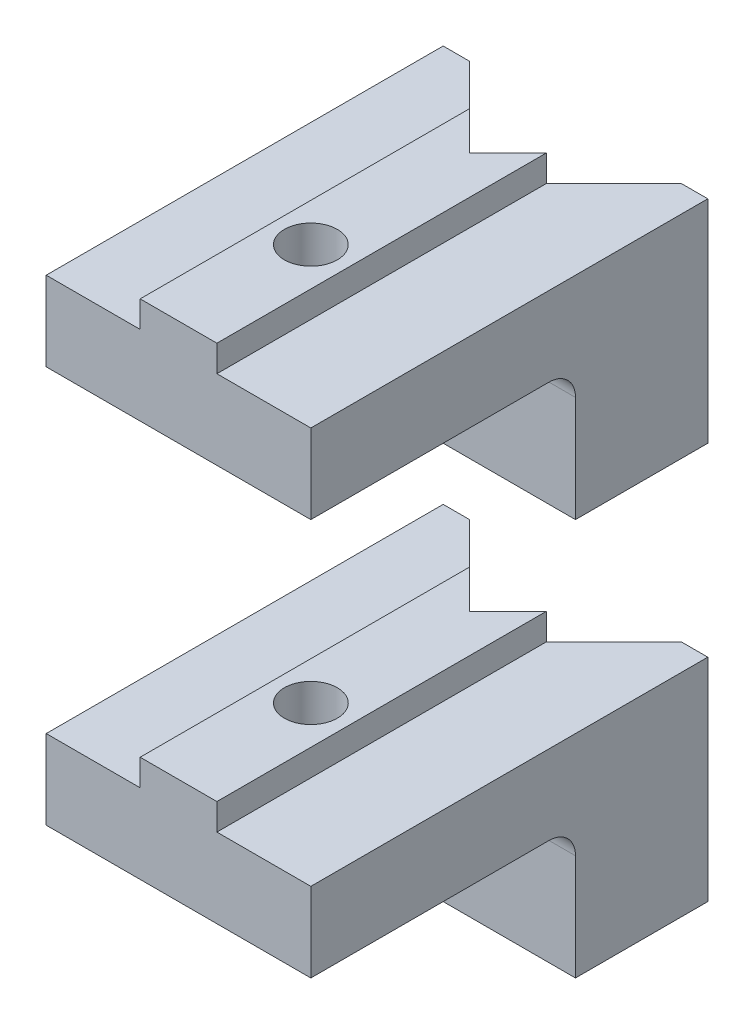
ISO-10303-21;
HEADER;
FILE_DESCRIPTION(('STEP AP214'),'2;1');
FILE_NAME('part.step','',(''),(''),'','','');
FILE_SCHEMA(('AUTOMOTIVE_DESIGN { 1 0 10303 214 1 1 1 1 }'));
ENDSEC;
DATA;
#1=APPLICATION_CONTEXT('core data for automotive mechanical design processes');
#2=APPLICATION_PROTOCOL_DEFINITION('international standard','automotive_design',2000,#1);
#3=PRODUCT_CONTEXT('',#1,'mechanical');
#4=PRODUCT('Part','Part','',(#3));
#5=PRODUCT_RELATED_PRODUCT_CATEGORY('part','',(#4));
#6=PRODUCT_DEFINITION_FORMATION('','',#4);
#7=PRODUCT_DEFINITION_CONTEXT('part definition',#1,'design');
#8=PRODUCT_DEFINITION('design','',#6,#7);
#9=PRODUCT_DEFINITION_SHAPE('','',#8);
#10=(LENGTH_UNIT() NAMED_UNIT(*) SI_UNIT(.MILLI.,.METRE.));
#11=(NAMED_UNIT(*) PLANE_ANGLE_UNIT() SI_UNIT($,.RADIAN.));
#12=(NAMED_UNIT(*) SI_UNIT($,.STERADIAN.) SOLID_ANGLE_UNIT());
#13=UNCERTAINTY_MEASURE_WITH_UNIT(LENGTH_MEASURE(1.E-05),#10,'distance_accuracy_value','');
#14=(GEOMETRIC_REPRESENTATION_CONTEXT(3) GLOBAL_UNCERTAINTY_ASSIGNED_CONTEXT((#13)) GLOBAL_UNIT_ASSIGNED_CONTEXT((#10,
#11,#12)) REPRESENTATION_CONTEXT('',''));
#15=CARTESIAN_POINT('',(0.,0.,0.));
#16=DIRECTION('',(0.,0.,1.));
#17=DIRECTION('',(1.,0.,0.));
#18=AXIS2_PLACEMENT_3D('',#15,#16,#17);
#19=CARTESIAN_POINT('',(5.,15.,15.));
#20=DIRECTION('',(0.,1.,0.));
#21=DIRECTION('',(-1.,0.,0.));
#22=AXIS2_PLACEMENT_3D('',#19,#20,#21);
#23=PLANE('',#22);
#24=CARTESIAN_POINT('',(0.,15.,10.));
#25=DIRECTION('',(0.,1.,0.));
#26=DIRECTION('',(0.,0.,1.));
#27=AXIS2_PLACEMENT_3D('',#24,#25,#26);
#28=CIRCLE('',#27,1.);
#29=CARTESIAN_POINT('',(0.,15.,11.));
#30=VERTEX_POINT('',#29);
#31=EDGE_CURVE('E154',#30,#30,#28,.T.);
#32=ORIENTED_EDGE('',*,*,#31,.T.);
#33=EDGE_LOOP('',(#32));
#34=FACE_BOUND('',#33,.T.);
#35=DIRECTION('',(0.,0.,-1.));
#36=VECTOR('',#35,1.);
#37=CARTESIAN_POINT('',(-5.,15.,15.));
#38=LINE('',#37,#36);
#39=CARTESIAN_POINT('',(-5.,15.,15.));
#40=VERTEX_POINT('',#39);
#41=CARTESIAN_POINT('',(-5.,15.,6.));
#42=VERTEX_POINT('',#41);
#43=EDGE_CURVE('E227',#40,#42,#38,.T.);
#44=ORIENTED_EDGE('',*,*,#43,.T.);
#45=DIRECTION('',(-1.,0.,0.));
#46=VECTOR('',#45,1.);
#47=CARTESIAN_POINT('',(5.,15.,6.));
#48=LINE('',#47,#46);
#49=CARTESIAN_POINT('',(5.,15.,6.));
#50=VERTEX_POINT('',#49);
#51=EDGE_CURVE('E63',#42,#50,#48,.F.);
#52=ORIENTED_EDGE('',*,*,#51,.T.);
#53=DIRECTION('',(0.,0.,-1.));
#54=VECTOR('',#53,1.);
#55=CARTESIAN_POINT('',(5.,15.,15.));
#56=LINE('',#55,#54);
#57=CARTESIAN_POINT('',(5.,15.,15.));
#58=VERTEX_POINT('',#57);
#59=EDGE_CURVE('E251',#58,#50,#56,.T.);
#60=ORIENTED_EDGE('',*,*,#59,.F.);
#61=DIRECTION('',(1.,0.,0.));
#62=VECTOR('',#61,1.);
#63=CARTESIAN_POINT('',(5.,15.,15.));
#64=LINE('',#63,#62);
#65=EDGE_CURVE('E210',#40,#58,#64,.T.);
#66=ORIENTED_EDGE('',*,*,#65,.F.);
#67=EDGE_LOOP('',(#44,#52,#60,#66));
#68=FACE_BOUND('',#67,.T.);
#69=ADVANCED_FACE('F42',(#34,#68),#23,.F.);
#70=CARTESIAN_POINT('',(0.,15.,0.));
#71=DIRECTION('',(0.,0.,-1.));
#72=DIRECTION('',(-1.,0.,0.));
#73=AXIS2_PLACEMENT_3D('',#70,#71,#72);
#74=PLANE('',#73);
#75=DIRECTION('',(0.,1.,0.));
#76=VECTOR('',#75,1.);
#77=CARTESIAN_POINT('',(-4.,15.,0.));
#78=LINE('',#77,#76);
#79=CARTESIAN_POINT('',(-4.,10.,0.));
#80=VERTEX_POINT('',#79);
#81=CARTESIAN_POINT('',(-4.,18.,0.));
#82=VERTEX_POINT('',#81);
#83=EDGE_CURVE('E255',#80,#82,#78,.T.);
#84=ORIENTED_EDGE('',*,*,#83,.F.);
#85=DIRECTION('',(1.,0.,0.));
#86=VECTOR('',#85,1.);
#87=CARTESIAN_POINT('',(-5.,10.,0.));
#88=LINE('',#87,#86);
#89=CARTESIAN_POINT('',(-5.,10.,0.));
#90=VERTEX_POINT('',#89);
#91=EDGE_CURVE('E176',#90,#80,#88,.T.);
#92=ORIENTED_EDGE('',*,*,#91,.F.);
#93=DIRECTION('',(0.,-1.,0.));
#94=VECTOR('',#93,1.);
#95=CARTESIAN_POINT('',(-5.,15.,0.));
#96=LINE('',#95,#94);
#97=CARTESIAN_POINT('',(-5.,18.,0.));
#98=VERTEX_POINT('',#97);
#99=EDGE_CURVE('E214',#98,#90,#96,.T.);
#100=ORIENTED_EDGE('',*,*,#99,.F.);
#101=DIRECTION('',(-1.,0.,0.));
#102=VECTOR('',#101,1.);
#103=CARTESIAN_POINT('',(-5.,18.,0.));
#104=LINE('',#103,#102);
#105=EDGE_CURVE('E230',#82,#98,#104,.T.);
#106=ORIENTED_EDGE('',*,*,#105,.F.);
#107=EDGE_LOOP('',(#84,#92,#100,#106));
#108=FACE_BOUND('',#107,.T.);
#109=ADVANCED_FACE('F272',(#108),#74,.T.);
#110=CARTESIAN_POINT('',(5.,18.,15.));
#111=DIRECTION('',(-1.,0.,0.));
#112=DIRECTION('',(0.,-1.,0.));
#113=AXIS2_PLACEMENT_3D('',#110,#111,#112);
#114=PLANE('',#113);
#115=DIRECTION('',(0.,1.,0.));
#116=VECTOR('',#115,1.);
#117=CARTESIAN_POINT('',(5.,18.,0.));
#118=LINE('',#117,#116);
#119=CARTESIAN_POINT('',(5.,10.,0.));
#120=VERTEX_POINT('',#119);
#121=CARTESIAN_POINT('',(5.,18.,0.));
#122=VERTEX_POINT('',#121);
#123=EDGE_CURVE('E143',#120,#122,#118,.T.);
#124=ORIENTED_EDGE('',*,*,#123,.T.);
#125=DIRECTION('',(0.,0.,-1.));
#126=VECTOR('',#125,1.);
#127=CARTESIAN_POINT('',(5.,18.,15.));
#128=LINE('',#127,#126);
#129=CARTESIAN_POINT('',(5.,18.,15.));
#130=VERTEX_POINT('',#129);
#131=EDGE_CURVE('E249',#130,#122,#128,.T.);
#132=ORIENTED_EDGE('',*,*,#131,.F.);
#133=DIRECTION('',(0.,1.,0.));
#134=VECTOR('',#133,1.);
#135=CARTESIAN_POINT('',(5.,18.,15.));
#136=LINE('',#135,#134);
#137=EDGE_CURVE('E213',#58,#130,#136,.T.);
#138=ORIENTED_EDGE('',*,*,#137,.F.);
#139=ORIENTED_EDGE('',*,*,#59,.T.);
#140=CARTESIAN_POINT('',(5.,14.,6.));
#141=DIRECTION('',(-1.,0.,0.));
#142=DIRECTION('',(0.,-1.,0.));
#143=AXIS2_PLACEMENT_3D('',#140,#141,#142);
#144=CIRCLE('',#143,1.);
#145=CARTESIAN_POINT('',(5.,14.,5.));
#146=VERTEX_POINT('',#145);
#147=EDGE_CURVE('E12',#50,#146,#144,.T.);
#148=ORIENTED_EDGE('',*,*,#147,.T.);
#149=DIRECTION('',(0.,1.,0.));
#150=VECTOR('',#149,1.);
#151=CARTESIAN_POINT('',(5.,10.,5.));
#152=LINE('',#151,#150);
#153=CARTESIAN_POINT('',(5.,10.,5.));
#154=VERTEX_POINT('',#153);
#155=EDGE_CURVE('E160',#154,#146,#152,.T.);
#156=ORIENTED_EDGE('',*,*,#155,.F.);
#157=DIRECTION('',(0.,0.,1.));
#158=VECTOR('',#157,1.);
#159=CARTESIAN_POINT('',(5.,10.,0.));
#160=LINE('',#159,#158);
#161=EDGE_CURVE('E157',#120,#154,#160,.T.);
#162=ORIENTED_EDGE('',*,*,#161,.F.);
#163=EDGE_LOOP('',(#124,#132,#138,#139,#148,#156,#162));
#164=FACE_BOUND('',#163,.T.);
#165=ADVANCED_FACE('F158',(#164),#114,.F.);
#166=CARTESIAN_POINT('',(1.45,18.,15.));
#167=DIRECTION('',(0.,-1.,0.));
#168=DIRECTION('',(1.,0.,0.));
#169=AXIS2_PLACEMENT_3D('',#166,#167,#168);
#170=PLANE('',#169);
#171=DIRECTION('',(-1.,0.,0.));
#172=VECTOR('',#171,1.);
#173=CARTESIAN_POINT('',(1.45,18.,0.));
#174=LINE('',#173,#172);
#175=CARTESIAN_POINT('',(4.,18.,0.));
#176=VERTEX_POINT('',#175);
#177=EDGE_CURVE('E150',#122,#176,#174,.T.);
#178=ORIENTED_EDGE('',*,*,#177,.T.);
#179=DIRECTION('',(-0.707106781186548,0.,0.707106781186548));
#180=VECTOR('',#179,1.);
#181=CARTESIAN_POINT('',(-4.775,18.,8.775));
#182=LINE('',#181,#180);
#183=CARTESIAN_POINT('',(1.45,18.,2.55));
#184=VERTEX_POINT('',#183);
#185=EDGE_CURVE('E193',#176,#184,#182,.T.);
#186=ORIENTED_EDGE('',*,*,#185,.T.);
#187=DIRECTION('',(0.,0.,-1.));
#188=VECTOR('',#187,1.);
#189=CARTESIAN_POINT('',(1.45,18.,15.));
#190=LINE('',#189,#188);
#191=CARTESIAN_POINT('',(1.45,18.,15.));
#192=VERTEX_POINT('',#191);
#193=EDGE_CURVE('E246',#192,#184,#190,.T.);
#194=ORIENTED_EDGE('',*,*,#193,.F.);
#195=DIRECTION('',(-1.,0.,0.));
#196=VECTOR('',#195,1.);
#197=CARTESIAN_POINT('',(1.45,18.,15.));
#198=LINE('',#197,#196);
#199=EDGE_CURVE('E216',#130,#192,#198,.T.);
#200=ORIENTED_EDGE('',*,*,#199,.F.);
#201=ORIENTED_EDGE('',*,*,#131,.T.);
#202=EDGE_LOOP('',(#178,#186,#194,#200,#201));
#203=FACE_BOUND('',#202,.T.);
#204=ADVANCED_FACE('F298',(#203),#170,.F.);
#205=CARTESIAN_POINT('',(1.45,19.,15.));
#206=DIRECTION('',(-1.,0.,0.));
#207=DIRECTION('',(0.,-1.,0.));
#208=AXIS2_PLACEMENT_3D('',#205,#206,#207);
#209=PLANE('',#208);
#210=ORIENTED_EDGE('',*,*,#193,.T.);
#211=DIRECTION('',(0.,1.,0.));
#212=VECTOR('',#211,1.);
#213=CARTESIAN_POINT('',(1.45,19.,2.55));
#214=LINE('',#213,#212);
#215=CARTESIAN_POINT('',(1.45,19.,2.55));
#216=VERTEX_POINT('',#215);
#217=EDGE_CURVE('E196',#184,#216,#214,.T.);
#218=ORIENTED_EDGE('',*,*,#217,.T.);
#219=DIRECTION('',(0.,0.,-1.));
#220=VECTOR('',#219,1.);
#221=CARTESIAN_POINT('',(1.45,19.,15.));
#222=LINE('',#221,#220);
#223=CARTESIAN_POINT('',(1.45,19.,15.));
#224=VERTEX_POINT('',#223);
#225=EDGE_CURVE('E243',#224,#216,#222,.T.);
#226=ORIENTED_EDGE('',*,*,#225,.F.);
#227=DIRECTION('',(0.,1.,0.));
#228=VECTOR('',#227,1.);
#229=CARTESIAN_POINT('',(1.45,19.,15.));
#230=LINE('',#229,#228);
#231=EDGE_CURVE('E218',#192,#224,#230,.T.);
#232=ORIENTED_EDGE('',*,*,#231,.F.);
#233=EDGE_LOOP('',(#210,#218,#226,#232));
#234=FACE_BOUND('',#233,.T.);
#235=ADVANCED_FACE('F293',(#234),#209,.F.);
#236=CARTESIAN_POINT('',(-1.45,19.,15.));
#237=DIRECTION('',(0.,-1.,0.));
#238=DIRECTION('',(1.,0.,0.));
#239=AXIS2_PLACEMENT_3D('',#236,#237,#238);
#240=PLANE('',#239);
#241=CARTESIAN_POINT('',(0.,19.,10.));
#242=DIRECTION('',(0.,1.,0.));
#243=DIRECTION('',(0.,0.,1.));
#244=AXIS2_PLACEMENT_3D('',#241,#242,#243);
#245=CIRCLE('',#244,1.);
#246=CARTESIAN_POINT('',(0.,19.,11.));
#247=VERTEX_POINT('',#246);
#248=EDGE_CURVE('E205',#247,#247,#245,.T.);
#249=ORIENTED_EDGE('',*,*,#248,.F.);
#250=EDGE_LOOP('',(#249));
#251=FACE_BOUND('',#250,.T.);
#252=DIRECTION('',(-0.707106781186548,0.,0.707106781186548));
#253=VECTOR('',#252,1.);
#254=CARTESIAN_POINT('',(0.,19.,4.));
#255=LINE('',#254,#253);
#256=CARTESIAN_POINT('',(0.,19.,4.));
#257=VERTEX_POINT('',#256);
#258=EDGE_CURVE('E185',#216,#257,#255,.T.);
#259=ORIENTED_EDGE('',*,*,#258,.T.);
#260=DIRECTION('',(-0.707106781186548,0.,-0.707106781186547));
#261=VECTOR('',#260,1.);
#262=CARTESIAN_POINT('',(-5.,19.,-1.));
#263=LINE('',#262,#261);
#264=CARTESIAN_POINT('',(-1.45,19.,2.55));
#265=VERTEX_POINT('',#264);
#266=EDGE_CURVE('E188',#257,#265,#263,.T.);
#267=ORIENTED_EDGE('',*,*,#266,.T.);
#268=DIRECTION('',(0.,0.,-1.));
#269=VECTOR('',#268,1.);
#270=CARTESIAN_POINT('',(-1.45,19.,15.));
#271=LINE('',#270,#269);
#272=CARTESIAN_POINT('',(-1.45,19.,15.));
#273=VERTEX_POINT('',#272);
#274=EDGE_CURVE('E240',#273,#265,#271,.T.);
#275=ORIENTED_EDGE('',*,*,#274,.F.);
#276=DIRECTION('',(-1.,0.,0.));
#277=VECTOR('',#276,1.);
#278=CARTESIAN_POINT('',(-1.45,19.,15.));
#279=LINE('',#278,#277);
#280=EDGE_CURVE('E220',#224,#273,#279,.T.);
#281=ORIENTED_EDGE('',*,*,#280,.F.);
#282=ORIENTED_EDGE('',*,*,#225,.T.);
#283=EDGE_LOOP('',(#259,#267,#275,#281,#282));
#284=FACE_BOUND('',#283,.T.);
#285=ADVANCED_FACE('F287',(#251,#284),#240,.F.);
#286=CARTESIAN_POINT('',(-1.45,18.,15.));
#287=DIRECTION('',(1.,0.,0.));
#288=DIRECTION('',(0.,0.,-1.));
#289=AXIS2_PLACEMENT_3D('',#286,#287,#288);
#290=PLANE('',#289);
#291=ORIENTED_EDGE('',*,*,#274,.T.);
#292=DIRECTION('',(0.,-1.,0.));
#293=VECTOR('',#292,1.);
#294=CARTESIAN_POINT('',(-1.45,18.,2.55));
#295=LINE('',#294,#293);
#296=CARTESIAN_POINT('',(-1.45,18.,2.55));
#297=VERTEX_POINT('',#296);
#298=EDGE_CURVE('E202',#265,#297,#295,.T.);
#299=ORIENTED_EDGE('',*,*,#298,.T.);
#300=DIRECTION('',(0.,0.,-1.));
#301=VECTOR('',#300,1.);
#302=CARTESIAN_POINT('',(-1.45,18.,15.));
#303=LINE('',#302,#301);
#304=CARTESIAN_POINT('',(-1.45,18.,15.));
#305=VERTEX_POINT('',#304);
#306=EDGE_CURVE('E237',#305,#297,#303,.T.);
#307=ORIENTED_EDGE('',*,*,#306,.F.);
#308=DIRECTION('',(0.,-1.,0.));
#309=VECTOR('',#308,1.);
#310=CARTESIAN_POINT('',(-1.45,18.,15.));
#311=LINE('',#310,#309);
#312=EDGE_CURVE('E222',#273,#305,#311,.T.);
#313=ORIENTED_EDGE('',*,*,#312,.F.);
#314=EDGE_LOOP('',(#291,#299,#307,#313));
#315=FACE_BOUND('',#314,.T.);
#316=ADVANCED_FACE('F284',(#315),#290,.F.);
#317=CARTESIAN_POINT('',(-5.,18.,15.));
#318=DIRECTION('',(0.,-1.,0.));
#319=DIRECTION('',(0.,0.,-1.));
#320=AXIS2_PLACEMENT_3D('',#317,#318,#319);
#321=PLANE('',#320);
#322=ORIENTED_EDGE('',*,*,#306,.T.);
#323=DIRECTION('',(-0.707106781186548,0.,-0.707106781186547));
#324=VECTOR('',#323,1.);
#325=CARTESIAN_POINT('',(3.,18.,7.));
#326=LINE('',#325,#324);
#327=EDGE_CURVE('E199',#297,#82,#326,.T.);
#328=ORIENTED_EDGE('',*,*,#327,.T.);
#329=ORIENTED_EDGE('',*,*,#105,.T.);
#330=DIRECTION('',(0.,0.,-1.));
#331=VECTOR('',#330,1.);
#332=CARTESIAN_POINT('',(-5.,18.,15.));
#333=LINE('',#332,#331);
#334=CARTESIAN_POINT('',(-5.,18.,15.));
#335=VERTEX_POINT('',#334);
#336=EDGE_CURVE('E234',#335,#98,#333,.T.);
#337=ORIENTED_EDGE('',*,*,#336,.F.);
#338=DIRECTION('',(-1.,0.,0.));
#339=VECTOR('',#338,1.);
#340=CARTESIAN_POINT('',(-5.,18.,15.));
#341=LINE('',#340,#339);
#342=EDGE_CURVE('E224',#305,#335,#341,.T.);
#343=ORIENTED_EDGE('',*,*,#342,.F.);
#344=EDGE_LOOP('',(#322,#328,#329,#337,#343));
#345=FACE_BOUND('',#344,.T.);
#346=ADVANCED_FACE('F278',(#345),#321,.F.);
#347=CARTESIAN_POINT('',(-5.,15.,15.));
#348=DIRECTION('',(1.,0.,0.));
#349=DIRECTION('',(0.,0.,-1.));
#350=AXIS2_PLACEMENT_3D('',#347,#348,#349);
#351=PLANE('',#350);
#352=ORIENTED_EDGE('',*,*,#99,.T.);
#353=DIRECTION('',(0.,0.,-1.));
#354=VECTOR('',#353,1.);
#355=CARTESIAN_POINT('',(-5.,10.,5.));
#356=LINE('',#355,#354);
#357=CARTESIAN_POINT('',(-5.,10.,5.));
#358=VERTEX_POINT('',#357);
#359=EDGE_CURVE('E173',#358,#90,#356,.T.);
#360=ORIENTED_EDGE('',*,*,#359,.F.);
#361=DIRECTION('',(0.,1.,0.));
#362=VECTOR('',#361,1.);
#363=CARTESIAN_POINT('',(-5.,10.,5.));
#364=LINE('',#363,#362);
#365=CARTESIAN_POINT('',(-5.,14.,5.));
#366=VERTEX_POINT('',#365);
#367=EDGE_CURVE('E182',#358,#366,#364,.T.);
#368=ORIENTED_EDGE('',*,*,#367,.T.);
#369=CARTESIAN_POINT('',(-5.,14.,6.));
#370=DIRECTION('',(1.,0.,0.));
#371=DIRECTION('',(0.,0.,-1.));
#372=AXIS2_PLACEMENT_3D('',#369,#370,#371);
#373=CIRCLE('',#372,1.);
#374=EDGE_CURVE('E50',#366,#42,#373,.T.);
#375=ORIENTED_EDGE('',*,*,#374,.T.);
#376=ORIENTED_EDGE('',*,*,#43,.F.);
#377=DIRECTION('',(0.,-1.,0.));
#378=VECTOR('',#377,1.);
#379=CARTESIAN_POINT('',(-5.,15.,15.));
#380=LINE('',#379,#378);
#381=EDGE_CURVE('E226',#335,#40,#380,.T.);
#382=ORIENTED_EDGE('',*,*,#381,.F.);
#383=ORIENTED_EDGE('',*,*,#336,.T.);
#384=EDGE_LOOP('',(#352,#360,#368,#375,#376,#382,#383));
#385=FACE_BOUND('',#384,.T.);
#386=ADVANCED_FACE('F267',(#385),#351,.F.);
#387=CARTESIAN_POINT('',(0.,15.,15.));
#388=DIRECTION('',(0.,0.,-1.));
#389=DIRECTION('',(-1.,0.,0.));
#390=AXIS2_PLACEMENT_3D('',#387,#388,#389);
#391=PLANE('',#390);
#392=ORIENTED_EDGE('',*,*,#65,.T.);
#393=ORIENTED_EDGE('',*,*,#137,.T.);
#394=ORIENTED_EDGE('',*,*,#199,.T.);
#395=ORIENTED_EDGE('',*,*,#231,.T.);
#396=ORIENTED_EDGE('',*,*,#280,.T.);
#397=ORIENTED_EDGE('',*,*,#312,.T.);
#398=ORIENTED_EDGE('',*,*,#342,.T.);
#399=ORIENTED_EDGE('',*,*,#381,.T.);
#400=EDGE_LOOP('',(#392,#393,#394,#395,#396,#397,#398,#399));
#401=FACE_BOUND('',#400,.T.);
#402=ADVANCED_FACE('F301',(#401),#391,.F.);
#403=DIRECTION('',(0.,-1.,0.));
#404=VECTOR('',#403,1.);
#405=CARTESIAN_POINT('',(4.,15.,0.));
#406=LINE('',#405,#404);
#407=CARTESIAN_POINT('',(4.,10.,0.));
#408=VERTEX_POINT('',#407);
#409=EDGE_CURVE('E253',#176,#408,#406,.T.);
#410=ORIENTED_EDGE('',*,*,#409,.F.);
#411=ORIENTED_EDGE('',*,*,#177,.F.);
#412=ORIENTED_EDGE('',*,*,#123,.F.);
#413=DIRECTION('',(1.,0.,0.));
#414=VECTOR('',#413,1.);
#415=CARTESIAN_POINT('',(4.,10.,0.));
#416=LINE('',#415,#414);
#417=EDGE_CURVE('E148',#408,#120,#416,.T.);
#418=ORIENTED_EDGE('',*,*,#417,.F.);
#419=EDGE_LOOP('',(#410,#411,#412,#418));
#420=FACE_BOUND('',#419,.T.);
#421=ADVANCED_FACE('F146',(#420),#74,.T.);
#422=CARTESIAN_POINT('',(0.,15.,10.));
#423=DIRECTION('',(0.,1.,0.));
#424=DIRECTION('',(0.,0.,1.));
#425=AXIS2_PLACEMENT_3D('',#422,#423,#424);
#426=CYLINDRICAL_SURFACE('',#425,1.);
#427=ORIENTED_EDGE('',*,*,#31,.F.);
#428=EDGE_LOOP('',(#427));
#429=FACE_BOUND('',#428,.T.);
#430=ORIENTED_EDGE('',*,*,#248,.T.);
#431=EDGE_LOOP('',(#430));
#432=FACE_BOUND('',#431,.T.);
#433=ADVANCED_FACE('F326',(#429,#432),#426,.F.);
#434=CARTESIAN_POINT('',(-5.,19.,-1.));
#435=DIRECTION('',(-0.707106781186547,0.,0.707106781186548));
#436=DIRECTION('',(0.707106781186548,0.,0.707106781186547));
#437=AXIS2_PLACEMENT_3D('',#434,#435,#436);
#438=PLANE('',#437);
#439=ORIENTED_EDGE('',*,*,#266,.F.);
#440=DIRECTION('',(0.,-1.,0.));
#441=VECTOR('',#440,1.);
#442=CARTESIAN_POINT('',(0.,19.,4.));
#443=LINE('',#442,#441);
#444=CARTESIAN_POINT('',(0.,10.,4.));
#445=VERTEX_POINT('',#444);
#446=EDGE_CURVE('E191',#257,#445,#443,.T.);
#447=ORIENTED_EDGE('',*,*,#446,.T.);
#448=DIRECTION('',(0.707106781186548,0.,0.707106781186547));
#449=VECTOR('',#448,1.);
#450=CARTESIAN_POINT('',(-4.,10.,0.));
#451=LINE('',#450,#449);
#452=EDGE_CURVE('E179',#80,#445,#451,.T.);
#453=ORIENTED_EDGE('',*,*,#452,.F.);
#454=ORIENTED_EDGE('',*,*,#83,.T.);
#455=ORIENTED_EDGE('',*,*,#327,.F.);
#456=ORIENTED_EDGE('',*,*,#298,.F.);
#457=EDGE_LOOP('',(#439,#447,#453,#454,#455,#456));
#458=FACE_BOUND('',#457,.T.);
#459=ADVANCED_FACE('F276',(#458),#438,.F.);
#460=CARTESIAN_POINT('',(0.,19.,4.));
#461=DIRECTION('',(0.707106781186548,0.,0.707106781186548));
#462=DIRECTION('',(0.707106781186548,0.,-0.707106781186548));
#463=AXIS2_PLACEMENT_3D('',#460,#461,#462);
#464=PLANE('',#463);
#465=ORIENTED_EDGE('',*,*,#185,.F.);
#466=ORIENTED_EDGE('',*,*,#409,.T.);
#467=DIRECTION('',(0.707106781186548,0.,-0.707106781186548));
#468=VECTOR('',#467,1.);
#469=CARTESIAN_POINT('',(0.,10.,4.));
#470=LINE('',#469,#468);
#471=EDGE_CURVE('E169',#445,#408,#470,.T.);
#472=ORIENTED_EDGE('',*,*,#471,.F.);
#473=ORIENTED_EDGE('',*,*,#446,.F.);
#474=ORIENTED_EDGE('',*,*,#258,.F.);
#475=ORIENTED_EDGE('',*,*,#217,.F.);
#476=EDGE_LOOP('',(#465,#466,#472,#473,#474,#475));
#477=FACE_BOUND('',#476,.T.);
#478=ADVANCED_FACE('F291',(#477),#464,.F.);
#479=CARTESIAN_POINT('',(5.,10.,5.));
#480=DIRECTION('',(0.,0.,-1.));
#481=DIRECTION('',(-1.,0.,0.));
#482=AXIS2_PLACEMENT_3D('',#479,#480,#481);
#483=PLANE('',#482);
#484=ORIENTED_EDGE('',*,*,#155,.T.);
#485=DIRECTION('',(-1.,0.,0.));
#486=VECTOR('',#485,1.);
#487=CARTESIAN_POINT('',(-5.,14.,5.));
#488=LINE('',#487,#486);
#489=EDGE_CURVE('E257',#146,#366,#488,.T.);
#490=ORIENTED_EDGE('',*,*,#489,.T.);
#491=ORIENTED_EDGE('',*,*,#367,.F.);
#492=DIRECTION('',(-1.,0.,0.));
#493=VECTOR('',#492,1.);
#494=CARTESIAN_POINT('',(5.,10.,5.));
#495=LINE('',#494,#493);
#496=EDGE_CURVE('E163',#154,#358,#495,.T.);
#497=ORIENTED_EDGE('',*,*,#496,.F.);
#498=EDGE_LOOP('',(#484,#490,#491,#497));
#499=FACE_BOUND('',#498,.T.);
#500=ADVANCED_FACE('F263',(#499),#483,.F.);
#501=CARTESIAN_POINT('',(0.,10.,0.));
#502=DIRECTION('',(0.,-1.,0.));
#503=DIRECTION('',(1.,0.,0.));
#504=AXIS2_PLACEMENT_3D('',#501,#502,#503);
#505=PLANE('',#504);
#506=ORIENTED_EDGE('',*,*,#417,.T.);
#507=ORIENTED_EDGE('',*,*,#161,.T.);
#508=ORIENTED_EDGE('',*,*,#496,.T.);
#509=ORIENTED_EDGE('',*,*,#359,.T.);
#510=ORIENTED_EDGE('',*,*,#91,.T.);
#511=ORIENTED_EDGE('',*,*,#452,.T.);
#512=ORIENTED_EDGE('',*,*,#471,.T.);
#513=EDGE_LOOP('',(#506,#507,#508,#509,#510,#511,#512));
#514=FACE_BOUND('',#513,.T.);
#515=ADVANCED_FACE('F166',(#514),#505,.T.);
#516=CARTESIAN_POINT('',(5.,14.,6.));
#517=DIRECTION('',(1.,0.,0.));
#518=DIRECTION('',(0.,1.,0.));
#519=AXIS2_PLACEMENT_3D('',#516,#517,#518);
#520=CYLINDRICAL_SURFACE('',#519,1.);
#521=ORIENTED_EDGE('',*,*,#147,.F.);
#522=ORIENTED_EDGE('',*,*,#51,.F.);
#523=ORIENTED_EDGE('',*,*,#374,.F.);
#524=ORIENTED_EDGE('',*,*,#489,.F.);
#525=EDGE_LOOP('',(#521,#522,#523,#524));
#526=FACE_BOUND('',#525,.T.);
#527=ADVANCED_FACE('F44',(#526),#520,.F.);
#528=CLOSED_SHELL('',(#69,#109,#165,#204,#235,#285,#316,#346,#386,#402,#421,#433,#459,#478,#500,
#515,#527));
#529=MANIFOLD_SOLID_BREP('B2',#528);
#530=CARTESIAN_POINT('',(5.,0.,15.));
#531=DIRECTION('',(0.,1.,0.));
#532=DIRECTION('',(-1.,0.,0.));
#533=AXIS2_PLACEMENT_3D('',#530,#531,#532);
#534=PLANE('',#533);
#535=CARTESIAN_POINT('',(0.,0.,10.));
#536=DIRECTION('',(0.,1.,0.));
#537=DIRECTION('',(0.,0.,1.));
#538=AXIS2_PLACEMENT_3D('',#535,#536,#537);
#539=CIRCLE('',#538,1.);
#540=CARTESIAN_POINT('',(0.,0.,11.));
#541=VERTEX_POINT('',#540);
#542=EDGE_CURVE('E575',#541,#541,#539,.T.);
#543=ORIENTED_EDGE('',*,*,#542,.T.);
#544=EDGE_LOOP('',(#543));
#545=FACE_BOUND('',#544,.T.);
#546=DIRECTION('',(0.,0.,-1.));
#547=VECTOR('',#546,1.);
#548=CARTESIAN_POINT('',(-5.,0.,15.));
#549=LINE('',#548,#547);
#550=CARTESIAN_POINT('',(-5.,0.,15.));
#551=VERTEX_POINT('',#550);
#552=CARTESIAN_POINT('',(-5.,0.,6.));
#553=VERTEX_POINT('',#552);
#554=EDGE_CURVE('E648',#551,#553,#549,.T.);
#555=ORIENTED_EDGE('',*,*,#554,.T.);
#556=DIRECTION('',(-1.,0.,0.));
#557=VECTOR('',#556,1.);
#558=CARTESIAN_POINT('',(5.,0.,6.));
#559=LINE('',#558,#557);
#560=CARTESIAN_POINT('',(5.,0.,6.));
#561=VERTEX_POINT('',#560);
#562=EDGE_CURVE('E484',#553,#561,#559,.F.);
#563=ORIENTED_EDGE('',*,*,#562,.T.);
#564=DIRECTION('',(0.,0.,-1.));
#565=VECTOR('',#564,1.);
#566=CARTESIAN_POINT('',(5.,0.,15.));
#567=LINE('',#566,#565);
#568=CARTESIAN_POINT('',(5.,0.,15.));
#569=VERTEX_POINT('',#568);
#570=EDGE_CURVE('E672',#569,#561,#567,.T.);
#571=ORIENTED_EDGE('',*,*,#570,.F.);
#572=DIRECTION('',(1.,0.,0.));
#573=VECTOR('',#572,1.);
#574=CARTESIAN_POINT('',(5.,0.,15.));
#575=LINE('',#574,#573);
#576=EDGE_CURVE('E631',#551,#569,#575,.T.);
#577=ORIENTED_EDGE('',*,*,#576,.F.);
#578=EDGE_LOOP('',(#555,#563,#571,#577));
#579=FACE_BOUND('',#578,.T.);
#580=ADVANCED_FACE('F463',(#545,#579),#534,.F.);
#581=CARTESIAN_POINT('',(0.,0.,0.));
#582=DIRECTION('',(0.,0.,-1.));
#583=DIRECTION('',(-1.,0.,0.));
#584=AXIS2_PLACEMENT_3D('',#581,#582,#583);
#585=PLANE('',#584);
#586=DIRECTION('',(0.,1.,0.));
#587=VECTOR('',#586,1.);
#588=CARTESIAN_POINT('',(-4.,0.,0.));
#589=LINE('',#588,#587);
#590=CARTESIAN_POINT('',(-4.,-5.,0.));
#591=VERTEX_POINT('',#590);
#592=CARTESIAN_POINT('',(-4.,3.,0.));
#593=VERTEX_POINT('',#592);
#594=EDGE_CURVE('E676',#591,#593,#589,.T.);
#595=ORIENTED_EDGE('',*,*,#594,.F.);
#596=DIRECTION('',(1.,0.,0.));
#597=VECTOR('',#596,1.);
#598=CARTESIAN_POINT('',(-5.,-5.,0.));
#599=LINE('',#598,#597);
#600=CARTESIAN_POINT('',(-5.,-5.,0.));
#601=VERTEX_POINT('',#600);
#602=EDGE_CURVE('E597',#601,#591,#599,.T.);
#603=ORIENTED_EDGE('',*,*,#602,.F.);
#604=DIRECTION('',(0.,-1.,0.));
#605=VECTOR('',#604,1.);
#606=CARTESIAN_POINT('',(-5.,0.,0.));
#607=LINE('',#606,#605);
#608=CARTESIAN_POINT('',(-5.,3.,0.));
#609=VERTEX_POINT('',#608);
#610=EDGE_CURVE('E635',#609,#601,#607,.T.);
#611=ORIENTED_EDGE('',*,*,#610,.F.);
#612=DIRECTION('',(-1.,0.,0.));
#613=VECTOR('',#612,1.);
#614=CARTESIAN_POINT('',(-5.,3.,0.));
#615=LINE('',#614,#613);
#616=EDGE_CURVE('E651',#593,#609,#615,.T.);
#617=ORIENTED_EDGE('',*,*,#616,.F.);
#618=EDGE_LOOP('',(#595,#603,#611,#617));
#619=FACE_BOUND('',#618,.T.);
#620=ADVANCED_FACE('F693',(#619),#585,.T.);
#621=CARTESIAN_POINT('',(5.,3.,15.));
#622=DIRECTION('',(-1.,0.,0.));
#623=DIRECTION('',(0.,-1.,0.));
#624=AXIS2_PLACEMENT_3D('',#621,#622,#623);
#625=PLANE('',#624);
#626=DIRECTION('',(0.,1.,0.));
#627=VECTOR('',#626,1.);
#628=CARTESIAN_POINT('',(5.,3.,0.));
#629=LINE('',#628,#627);
#630=CARTESIAN_POINT('',(5.,-5.,0.));
#631=VERTEX_POINT('',#630);
#632=CARTESIAN_POINT('',(5.,3.,0.));
#633=VERTEX_POINT('',#632);
#634=EDGE_CURVE('E564',#631,#633,#629,.T.);
#635=ORIENTED_EDGE('',*,*,#634,.T.);
#636=DIRECTION('',(0.,0.,-1.));
#637=VECTOR('',#636,1.);
#638=CARTESIAN_POINT('',(5.,3.,15.));
#639=LINE('',#638,#637);
#640=CARTESIAN_POINT('',(5.,3.,15.));
#641=VERTEX_POINT('',#640);
#642=EDGE_CURVE('E670',#641,#633,#639,.T.);
#643=ORIENTED_EDGE('',*,*,#642,.F.);
#644=DIRECTION('',(0.,1.,0.));
#645=VECTOR('',#644,1.);
#646=CARTESIAN_POINT('',(5.,3.,15.));
#647=LINE('',#646,#645);
#648=EDGE_CURVE('E634',#569,#641,#647,.T.);
#649=ORIENTED_EDGE('',*,*,#648,.F.);
#650=ORIENTED_EDGE('',*,*,#570,.T.);
#651=CARTESIAN_POINT('',(5.,-1.,6.));
#652=DIRECTION('',(-1.,0.,0.));
#653=DIRECTION('',(0.,-1.,0.));
#654=AXIS2_PLACEMENT_3D('',#651,#652,#653);
#655=CIRCLE('',#654,1.);
#656=CARTESIAN_POINT('',(5.,-1.,5.));
#657=VERTEX_POINT('',#656);
#658=EDGE_CURVE('E40',#561,#657,#655,.T.);
#659=ORIENTED_EDGE('',*,*,#658,.T.);
#660=DIRECTION('',(0.,1.,0.));
#661=VECTOR('',#660,1.);
#662=CARTESIAN_POINT('',(5.,-5.,5.));
#663=LINE('',#662,#661);
#664=CARTESIAN_POINT('',(5.,-5.,5.));
#665=VERTEX_POINT('',#664);
#666=EDGE_CURVE('E581',#665,#657,#663,.T.);
#667=ORIENTED_EDGE('',*,*,#666,.F.);
#668=DIRECTION('',(0.,0.,1.));
#669=VECTOR('',#668,1.);
#670=CARTESIAN_POINT('',(5.,-5.,0.));
#671=LINE('',#670,#669);
#672=EDGE_CURVE('E578',#631,#665,#671,.T.);
#673=ORIENTED_EDGE('',*,*,#672,.F.);
#674=EDGE_LOOP('',(#635,#643,#649,#650,#659,#667,#673));
#675=FACE_BOUND('',#674,.T.);
#676=ADVANCED_FACE('F579',(#675),#625,.F.);
#677=CARTESIAN_POINT('',(1.45,3.,15.));
#678=DIRECTION('',(0.,-1.,0.));
#679=DIRECTION('',(1.,0.,0.));
#680=AXIS2_PLACEMENT_3D('',#677,#678,#679);
#681=PLANE('',#680);
#682=DIRECTION('',(-1.,0.,0.));
#683=VECTOR('',#682,1.);
#684=CARTESIAN_POINT('',(1.45,3.,0.));
#685=LINE('',#684,#683);
#686=CARTESIAN_POINT('',(4.,3.,0.));
#687=VERTEX_POINT('',#686);
#688=EDGE_CURVE('E571',#633,#687,#685,.T.);
#689=ORIENTED_EDGE('',*,*,#688,.T.);
#690=DIRECTION('',(-0.707106781186548,0.,0.707106781186548));
#691=VECTOR('',#690,1.);
#692=CARTESIAN_POINT('',(-4.775,3.,8.775));
#693=LINE('',#692,#691);
#694=CARTESIAN_POINT('',(1.45,3.,2.55));
#695=VERTEX_POINT('',#694);
#696=EDGE_CURVE('E614',#687,#695,#693,.T.);
#697=ORIENTED_EDGE('',*,*,#696,.T.);
#698=DIRECTION('',(0.,0.,-1.));
#699=VECTOR('',#698,1.);
#700=CARTESIAN_POINT('',(1.45,3.,15.));
#701=LINE('',#700,#699);
#702=CARTESIAN_POINT('',(1.45,3.,15.));
#703=VERTEX_POINT('',#702);
#704=EDGE_CURVE('E667',#703,#695,#701,.T.);
#705=ORIENTED_EDGE('',*,*,#704,.F.);
#706=DIRECTION('',(-1.,0.,0.));
#707=VECTOR('',#706,1.);
#708=CARTESIAN_POINT('',(1.45,3.,15.));
#709=LINE('',#708,#707);
#710=EDGE_CURVE('E637',#641,#703,#709,.T.);
#711=ORIENTED_EDGE('',*,*,#710,.F.);
#712=ORIENTED_EDGE('',*,*,#642,.T.);
#713=EDGE_LOOP('',(#689,#697,#705,#711,#712));
#714=FACE_BOUND('',#713,.T.);
#715=ADVANCED_FACE('F719',(#714),#681,.F.);
#716=CARTESIAN_POINT('',(1.45,4.,15.));
#717=DIRECTION('',(-1.,0.,0.));
#718=DIRECTION('',(0.,-1.,0.));
#719=AXIS2_PLACEMENT_3D('',#716,#717,#718);
#720=PLANE('',#719);
#721=ORIENTED_EDGE('',*,*,#704,.T.);
#722=DIRECTION('',(0.,1.,0.));
#723=VECTOR('',#722,1.);
#724=CARTESIAN_POINT('',(1.45,4.00000000000001,2.55));
#725=LINE('',#724,#723);
#726=CARTESIAN_POINT('',(1.45,4.,2.55));
#727=VERTEX_POINT('',#726);
#728=EDGE_CURVE('E617',#695,#727,#725,.T.);
#729=ORIENTED_EDGE('',*,*,#728,.T.);
#730=DIRECTION('',(0.,0.,-1.));
#731=VECTOR('',#730,1.);
#732=CARTESIAN_POINT('',(1.45,4.,15.));
#733=LINE('',#732,#731);
#734=CARTESIAN_POINT('',(1.45,4.,15.));
#735=VERTEX_POINT('',#734);
#736=EDGE_CURVE('E664',#735,#727,#733,.T.);
#737=ORIENTED_EDGE('',*,*,#736,.F.);
#738=DIRECTION('',(0.,1.,0.));
#739=VECTOR('',#738,1.);
#740=CARTESIAN_POINT('',(1.45,4.,15.));
#741=LINE('',#740,#739);
#742=EDGE_CURVE('E639',#703,#735,#741,.T.);
#743=ORIENTED_EDGE('',*,*,#742,.F.);
#744=EDGE_LOOP('',(#721,#729,#737,#743));
#745=FACE_BOUND('',#744,.T.);
#746=ADVANCED_FACE('F714',(#745),#720,.F.);
#747=CARTESIAN_POINT('',(-1.45,4.,15.));
#748=DIRECTION('',(0.,-1.,0.));
#749=DIRECTION('',(1.,0.,0.));
#750=AXIS2_PLACEMENT_3D('',#747,#748,#749);
#751=PLANE('',#750);
#752=CARTESIAN_POINT('',(0.,4.,10.));
#753=DIRECTION('',(0.,1.,0.));
#754=DIRECTION('',(0.,0.,1.));
#755=AXIS2_PLACEMENT_3D('',#752,#753,#754);
#756=CIRCLE('',#755,1.);
#757=CARTESIAN_POINT('',(0.,4.,11.));
#758=VERTEX_POINT('',#757);
#759=EDGE_CURVE('E626',#758,#758,#756,.T.);
#760=ORIENTED_EDGE('',*,*,#759,.F.);
#761=EDGE_LOOP('',(#760));
#762=FACE_BOUND('',#761,.T.);
#763=DIRECTION('',(-0.707106781186548,0.,0.707106781186548));
#764=VECTOR('',#763,1.);
#765=CARTESIAN_POINT('',(0.,4.,4.));
#766=LINE('',#765,#764);
#767=CARTESIAN_POINT('',(0.,4.,4.));
#768=VERTEX_POINT('',#767);
#769=EDGE_CURVE('E606',#727,#768,#766,.T.);
#770=ORIENTED_EDGE('',*,*,#769,.T.);
#771=DIRECTION('',(-0.707106781186548,0.,-0.707106781186547));
#772=VECTOR('',#771,1.);
#773=CARTESIAN_POINT('',(-5.,4.,-1.));
#774=LINE('',#773,#772);
#775=CARTESIAN_POINT('',(-1.45,4.,2.55));
#776=VERTEX_POINT('',#775);
#777=EDGE_CURVE('E609',#768,#776,#774,.T.);
#778=ORIENTED_EDGE('',*,*,#777,.T.);
#779=DIRECTION('',(0.,0.,-1.));
#780=VECTOR('',#779,1.);
#781=CARTESIAN_POINT('',(-1.45,4.,15.));
#782=LINE('',#781,#780);
#783=CARTESIAN_POINT('',(-1.45,4.,15.));
#784=VERTEX_POINT('',#783);
#785=EDGE_CURVE('E661',#784,#776,#782,.T.);
#786=ORIENTED_EDGE('',*,*,#785,.F.);
#787=DIRECTION('',(-1.,0.,0.));
#788=VECTOR('',#787,1.);
#789=CARTESIAN_POINT('',(-1.45,4.,15.));
#790=LINE('',#789,#788);
#791=EDGE_CURVE('E641',#735,#784,#790,.T.);
#792=ORIENTED_EDGE('',*,*,#791,.F.);
#793=ORIENTED_EDGE('',*,*,#736,.T.);
#794=EDGE_LOOP('',(#770,#778,#786,#792,#793));
#795=FACE_BOUND('',#794,.T.);
#796=ADVANCED_FACE('F708',(#762,#795),#751,.F.);
#797=CARTESIAN_POINT('',(-1.45,3.,15.));
#798=DIRECTION('',(1.,0.,0.));
#799=DIRECTION('',(0.,0.,-1.));
#800=AXIS2_PLACEMENT_3D('',#797,#798,#799);
#801=PLANE('',#800);
#802=ORIENTED_EDGE('',*,*,#785,.T.);
#803=DIRECTION('',(0.,-1.,0.));
#804=VECTOR('',#803,1.);
#805=CARTESIAN_POINT('',(-1.45,3.,2.55));
#806=LINE('',#805,#804);
#807=CARTESIAN_POINT('',(-1.45,3.,2.55));
#808=VERTEX_POINT('',#807);
#809=EDGE_CURVE('E623',#776,#808,#806,.T.);
#810=ORIENTED_EDGE('',*,*,#809,.T.);
#811=DIRECTION('',(0.,0.,-1.));
#812=VECTOR('',#811,1.);
#813=CARTESIAN_POINT('',(-1.45,3.,15.));
#814=LINE('',#813,#812);
#815=CARTESIAN_POINT('',(-1.45,3.,15.));
#816=VERTEX_POINT('',#815);
#817=EDGE_CURVE('E658',#816,#808,#814,.T.);
#818=ORIENTED_EDGE('',*,*,#817,.F.);
#819=DIRECTION('',(0.,-1.,0.));
#820=VECTOR('',#819,1.);
#821=CARTESIAN_POINT('',(-1.45,3.,15.));
#822=LINE('',#821,#820);
#823=EDGE_CURVE('E643',#784,#816,#822,.T.);
#824=ORIENTED_EDGE('',*,*,#823,.F.);
#825=EDGE_LOOP('',(#802,#810,#818,#824));
#826=FACE_BOUND('',#825,.T.);
#827=ADVANCED_FACE('F705',(#826),#801,.F.);
#828=CARTESIAN_POINT('',(-5.,3.,15.));
#829=DIRECTION('',(0.,-1.,0.));
#830=DIRECTION('',(0.,0.,-1.));
#831=AXIS2_PLACEMENT_3D('',#828,#829,#830);
#832=PLANE('',#831);
#833=ORIENTED_EDGE('',*,*,#817,.T.);
#834=DIRECTION('',(-0.707106781186548,0.,-0.707106781186547));
#835=VECTOR('',#834,1.);
#836=CARTESIAN_POINT('',(3.,3.,7.));
#837=LINE('',#836,#835);
#838=EDGE_CURVE('E620',#808,#593,#837,.T.);
#839=ORIENTED_EDGE('',*,*,#838,.T.);
#840=ORIENTED_EDGE('',*,*,#616,.T.);
#841=DIRECTION('',(0.,0.,-1.));
#842=VECTOR('',#841,1.);
#843=CARTESIAN_POINT('',(-5.,3.,15.));
#844=LINE('',#843,#842);
#845=CARTESIAN_POINT('',(-5.,3.,15.));
#846=VERTEX_POINT('',#845);
#847=EDGE_CURVE('E655',#846,#609,#844,.T.);
#848=ORIENTED_EDGE('',*,*,#847,.F.);
#849=DIRECTION('',(-1.,0.,0.));
#850=VECTOR('',#849,1.);
#851=CARTESIAN_POINT('',(-5.,3.,15.));
#852=LINE('',#851,#850);
#853=EDGE_CURVE('E645',#816,#846,#852,.T.);
#854=ORIENTED_EDGE('',*,*,#853,.F.);
#855=EDGE_LOOP('',(#833,#839,#840,#848,#854));
#856=FACE_BOUND('',#855,.T.);
#857=ADVANCED_FACE('F699',(#856),#832,.F.);
#858=CARTESIAN_POINT('',(-5.,0.,15.));
#859=DIRECTION('',(1.,0.,0.));
#860=DIRECTION('',(0.,0.,-1.));
#861=AXIS2_PLACEMENT_3D('',#858,#859,#860);
#862=PLANE('',#861);
#863=ORIENTED_EDGE('',*,*,#610,.T.);
#864=DIRECTION('',(0.,0.,-1.));
#865=VECTOR('',#864,1.);
#866=CARTESIAN_POINT('',(-5.,-5.,5.));
#867=LINE('',#866,#865);
#868=CARTESIAN_POINT('',(-5.,-5.,5.));
#869=VERTEX_POINT('',#868);
#870=EDGE_CURVE('E594',#869,#601,#867,.T.);
#871=ORIENTED_EDGE('',*,*,#870,.F.);
#872=DIRECTION('',(0.,1.,0.));
#873=VECTOR('',#872,1.);
#874=CARTESIAN_POINT('',(-5.,-5.,5.));
#875=LINE('',#874,#873);
#876=CARTESIAN_POINT('',(-5.,-1.,5.));
#877=VERTEX_POINT('',#876);
#878=EDGE_CURVE('E603',#869,#877,#875,.T.);
#879=ORIENTED_EDGE('',*,*,#878,.T.);
#880=CARTESIAN_POINT('',(-5.,-1.,6.));
#881=DIRECTION('',(1.,0.,0.));
#882=DIRECTION('',(0.,0.,-1.));
#883=AXIS2_PLACEMENT_3D('',#880,#881,#882);
#884=CIRCLE('',#883,1.);
#885=EDGE_CURVE('E471',#877,#553,#884,.T.);
#886=ORIENTED_EDGE('',*,*,#885,.T.);
#887=ORIENTED_EDGE('',*,*,#554,.F.);
#888=DIRECTION('',(0.,-1.,0.));
#889=VECTOR('',#888,1.);
#890=CARTESIAN_POINT('',(-5.,0.,15.));
#891=LINE('',#890,#889);
#892=EDGE_CURVE('E647',#846,#551,#891,.T.);
#893=ORIENTED_EDGE('',*,*,#892,.F.);
#894=ORIENTED_EDGE('',*,*,#847,.T.);
#895=EDGE_LOOP('',(#863,#871,#879,#886,#887,#893,#894));
#896=FACE_BOUND('',#895,.T.);
#897=ADVANCED_FACE('F688',(#896),#862,.F.);
#898=CARTESIAN_POINT('',(0.,0.,15.));
#899=DIRECTION('',(0.,0.,-1.));
#900=DIRECTION('',(-1.,0.,0.));
#901=AXIS2_PLACEMENT_3D('',#898,#899,#900);
#902=PLANE('',#901);
#903=ORIENTED_EDGE('',*,*,#576,.T.);
#904=ORIENTED_EDGE('',*,*,#648,.T.);
#905=ORIENTED_EDGE('',*,*,#710,.T.);
#906=ORIENTED_EDGE('',*,*,#742,.T.);
#907=ORIENTED_EDGE('',*,*,#791,.T.);
#908=ORIENTED_EDGE('',*,*,#823,.T.);
#909=ORIENTED_EDGE('',*,*,#853,.T.);
#910=ORIENTED_EDGE('',*,*,#892,.T.);
#911=EDGE_LOOP('',(#903,#904,#905,#906,#907,#908,#909,#910));
#912=FACE_BOUND('',#911,.T.);
#913=ADVANCED_FACE('F722',(#912),#902,.F.);
#914=DIRECTION('',(0.,-1.,0.));
#915=VECTOR('',#914,1.);
#916=CARTESIAN_POINT('',(4.,0.,0.));
#917=LINE('',#916,#915);
#918=CARTESIAN_POINT('',(4.,-5.,0.));
#919=VERTEX_POINT('',#918);
#920=EDGE_CURVE('E674',#687,#919,#917,.T.);
#921=ORIENTED_EDGE('',*,*,#920,.F.);
#922=ORIENTED_EDGE('',*,*,#688,.F.);
#923=ORIENTED_EDGE('',*,*,#634,.F.);
#924=DIRECTION('',(1.,0.,0.));
#925=VECTOR('',#924,1.);
#926=CARTESIAN_POINT('',(4.,-5.,0.));
#927=LINE('',#926,#925);
#928=EDGE_CURVE('E569',#919,#631,#927,.T.);
#929=ORIENTED_EDGE('',*,*,#928,.F.);
#930=EDGE_LOOP('',(#921,#922,#923,#929));
#931=FACE_BOUND('',#930,.T.);
#932=ADVANCED_FACE('F567',(#931),#585,.T.);
#933=CARTESIAN_POINT('',(0.,0.,10.));
#934=DIRECTION('',(0.,1.,0.));
#935=DIRECTION('',(0.,0.,1.));
#936=AXIS2_PLACEMENT_3D('',#933,#934,#935);
#937=CYLINDRICAL_SURFACE('',#936,1.);
#938=ORIENTED_EDGE('',*,*,#542,.F.);
#939=EDGE_LOOP('',(#938));
#940=FACE_BOUND('',#939,.T.);
#941=ORIENTED_EDGE('',*,*,#759,.T.);
#942=EDGE_LOOP('',(#941));
#943=FACE_BOUND('',#942,.T.);
#944=ADVANCED_FACE('F747',(#940,#943),#937,.F.);
#945=CARTESIAN_POINT('',(-5.,4.,-1.));
#946=DIRECTION('',(-0.707106781186547,0.,0.707106781186548));
#947=DIRECTION('',(0.707106781186548,0.,0.707106781186547));
#948=AXIS2_PLACEMENT_3D('',#945,#946,#947);
#949=PLANE('',#948);
#950=ORIENTED_EDGE('',*,*,#777,.F.);
#951=DIRECTION('',(0.,-1.,0.));
#952=VECTOR('',#951,1.);
#953=CARTESIAN_POINT('',(0.,4.,4.));
#954=LINE('',#953,#952);
#955=CARTESIAN_POINT('',(0.,-5.,4.));
#956=VERTEX_POINT('',#955);
#957=EDGE_CURVE('E612',#768,#956,#954,.T.);
#958=ORIENTED_EDGE('',*,*,#957,.T.);
#959=DIRECTION('',(0.707106781186548,0.,0.707106781186547));
#960=VECTOR('',#959,1.);
#961=CARTESIAN_POINT('',(-4.,-5.,0.));
#962=LINE('',#961,#960);
#963=EDGE_CURVE('E600',#591,#956,#962,.T.);
#964=ORIENTED_EDGE('',*,*,#963,.F.);
#965=ORIENTED_EDGE('',*,*,#594,.T.);
#966=ORIENTED_EDGE('',*,*,#838,.F.);
#967=ORIENTED_EDGE('',*,*,#809,.F.);
#968=EDGE_LOOP('',(#950,#958,#964,#965,#966,#967));
#969=FACE_BOUND('',#968,.T.);
#970=ADVANCED_FACE('F697',(#969),#949,.F.);
#971=CARTESIAN_POINT('',(0.,4.,4.));
#972=DIRECTION('',(0.707106781186548,0.,0.707106781186548));
#973=DIRECTION('',(0.707106781186548,0.,-0.707106781186548));
#974=AXIS2_PLACEMENT_3D('',#971,#972,#973);
#975=PLANE('',#974);
#976=ORIENTED_EDGE('',*,*,#696,.F.);
#977=ORIENTED_EDGE('',*,*,#920,.T.);
#978=DIRECTION('',(0.707106781186548,0.,-0.707106781186548));
#979=VECTOR('',#978,1.);
#980=CARTESIAN_POINT('',(0.,-5.,4.));
#981=LINE('',#980,#979);
#982=EDGE_CURVE('E590',#956,#919,#981,.T.);
#983=ORIENTED_EDGE('',*,*,#982,.F.);
#984=ORIENTED_EDGE('',*,*,#957,.F.);
#985=ORIENTED_EDGE('',*,*,#769,.F.);
#986=ORIENTED_EDGE('',*,*,#728,.F.);
#987=EDGE_LOOP('',(#976,#977,#983,#984,#985,#986));
#988=FACE_BOUND('',#987,.T.);
#989=ADVANCED_FACE('F712',(#988),#975,.F.);
#990=CARTESIAN_POINT('',(5.,-5.,5.));
#991=DIRECTION('',(0.,0.,-1.));
#992=DIRECTION('',(-1.,0.,0.));
#993=AXIS2_PLACEMENT_3D('',#990,#991,#992);
#994=PLANE('',#993);
#995=ORIENTED_EDGE('',*,*,#666,.T.);
#996=DIRECTION('',(-1.,0.,0.));
#997=VECTOR('',#996,1.);
#998=CARTESIAN_POINT('',(-5.,-1.,5.));
#999=LINE('',#998,#997);
#1000=EDGE_CURVE('E678',#657,#877,#999,.T.);
#1001=ORIENTED_EDGE('',*,*,#1000,.T.);
#1002=ORIENTED_EDGE('',*,*,#878,.F.);
#1003=DIRECTION('',(-1.,0.,0.));
#1004=VECTOR('',#1003,1.);
#1005=CARTESIAN_POINT('',(5.,-5.,5.));
#1006=LINE('',#1005,#1004);
#1007=EDGE_CURVE('E584',#665,#869,#1006,.T.);
#1008=ORIENTED_EDGE('',*,*,#1007,.F.);
#1009=EDGE_LOOP('',(#995,#1001,#1002,#1008));
#1010=FACE_BOUND('',#1009,.T.);
#1011=ADVANCED_FACE('F684',(#1010),#994,.F.);
#1012=CARTESIAN_POINT('',(0.,-5.,0.));
#1013=DIRECTION('',(0.,-1.,0.));
#1014=DIRECTION('',(1.,0.,0.));
#1015=AXIS2_PLACEMENT_3D('',#1012,#1013,#1014);
#1016=PLANE('',#1015);
#1017=ORIENTED_EDGE('',*,*,#928,.T.);
#1018=ORIENTED_EDGE('',*,*,#672,.T.);
#1019=ORIENTED_EDGE('',*,*,#1007,.T.);
#1020=ORIENTED_EDGE('',*,*,#870,.T.);
#1021=ORIENTED_EDGE('',*,*,#602,.T.);
#1022=ORIENTED_EDGE('',*,*,#963,.T.);
#1023=ORIENTED_EDGE('',*,*,#982,.T.);
#1024=EDGE_LOOP('',(#1017,#1018,#1019,#1020,#1021,#1022,#1023));
#1025=FACE_BOUND('',#1024,.T.);
#1026=ADVANCED_FACE('F587',(#1025),#1016,.T.);
#1027=CARTESIAN_POINT('',(5.,-1.,6.));
#1028=DIRECTION('',(1.,0.,0.));
#1029=DIRECTION('',(0.,1.,0.));
#1030=AXIS2_PLACEMENT_3D('',#1027,#1028,#1029);
#1031=CYLINDRICAL_SURFACE('',#1030,1.);
#1032=ORIENTED_EDGE('',*,*,#658,.F.);
#1033=ORIENTED_EDGE('',*,*,#562,.F.);
#1034=ORIENTED_EDGE('',*,*,#885,.F.);
#1035=ORIENTED_EDGE('',*,*,#1000,.F.);
#1036=EDGE_LOOP('',(#1032,#1033,#1034,#1035));
#1037=FACE_BOUND('',#1036,.T.);
#1038=ADVANCED_FACE('F465',(#1037),#1031,.F.);
#1039=CLOSED_SHELL('',(#580,#620,#676,#715,#746,#796,#827,#857,#897,#913,#932,#944,#970,#989,
#1011,#1026,#1038));
#1040=MANIFOLD_SOLID_BREP('B6',#1039);
#1041=ADVANCED_BREP_SHAPE_REPRESENTATION('',(#18,#529,#1040),#14);
#1042=SHAPE_DEFINITION_REPRESENTATION(#9,#1041);
ENDSEC;
END-ISO-10303-21;
